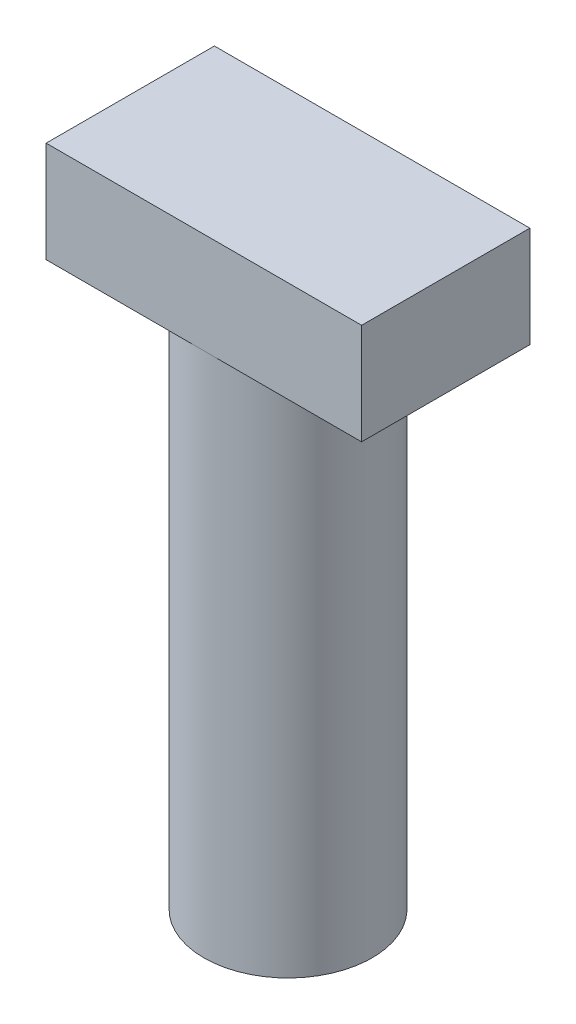
ISO-10303-21;
HEADER;
FILE_DESCRIPTION(('STEP AP214'),'2;1');
FILE_NAME('part.step','',(''),(''),'','','');
FILE_SCHEMA(('AUTOMOTIVE_DESIGN { 1 0 10303 214 1 1 1 1 }'));
ENDSEC;
DATA;
#1=APPLICATION_CONTEXT('core data for automotive mechanical design processes');
#2=APPLICATION_PROTOCOL_DEFINITION('international standard','automotive_design',2000,#1);
#3=PRODUCT_CONTEXT('',#1,'mechanical');
#4=PRODUCT('Part','Part','',(#3));
#5=PRODUCT_RELATED_PRODUCT_CATEGORY('part','',(#4));
#6=PRODUCT_DEFINITION_FORMATION('','',#4);
#7=PRODUCT_DEFINITION_CONTEXT('part definition',#1,'design');
#8=PRODUCT_DEFINITION('design','',#6,#7);
#9=PRODUCT_DEFINITION_SHAPE('','',#8);
#10=(LENGTH_UNIT() NAMED_UNIT(*) SI_UNIT(.MILLI.,.METRE.));
#11=(NAMED_UNIT(*) PLANE_ANGLE_UNIT() SI_UNIT($,.RADIAN.));
#12=(NAMED_UNIT(*) SI_UNIT($,.STERADIAN.) SOLID_ANGLE_UNIT());
#13=UNCERTAINTY_MEASURE_WITH_UNIT(LENGTH_MEASURE(1.E-05),#10,'distance_accuracy_value','');
#14=(GEOMETRIC_REPRESENTATION_CONTEXT(3) GLOBAL_UNCERTAINTY_ASSIGNED_CONTEXT((#13)) GLOBAL_UNIT_ASSIGNED_CONTEXT((#10,
#11,#12)) REPRESENTATION_CONTEXT('',''));
#15=CARTESIAN_POINT('',(0.,0.,0.));
#16=DIRECTION('',(0.,0.,1.));
#17=DIRECTION('',(1.,0.,0.));
#18=AXIS2_PLACEMENT_3D('',#15,#16,#17);
#19=CARTESIAN_POINT('',(0.,25.,0.));
#20=DIRECTION('',(0.,-1.,0.));
#21=DIRECTION('',(0.,0.,-1.));
#22=AXIS2_PLACEMENT_3D('',#19,#20,#21);
#23=CYLINDRICAL_SURFACE('',#22,4.);
#24=CARTESIAN_POINT('',(0.,25.,0.));
#25=DIRECTION('',(0.,1.,0.));
#26=DIRECTION('',(0.,0.,1.));
#27=AXIS2_PLACEMENT_3D('',#24,#25,#26);
#28=CIRCLE('',#27,4.);
#29=CARTESIAN_POINT('',(0.,25.,4.));
#30=VERTEX_POINT('',#29);
#31=CARTESIAN_POINT('',(0.,25.,-4.));
#32=VERTEX_POINT('',#31);
#33=EDGE_CURVE('E11',#30,#32,#28,.T.);
#34=ORIENTED_EDGE('',*,*,#33,.F.);
#35=EDGE_CURVE('E41',#32,#30,#28,.T.);
#36=ORIENTED_EDGE('',*,*,#35,.F.);
#37=EDGE_LOOP('',(#34,#36));
#38=FACE_BOUND('',#37,.T.);
#39=CARTESIAN_POINT('',(0.,0.,0.));
#40=DIRECTION('',(0.,1.,0.));
#41=DIRECTION('',(0.,0.,1.));
#42=AXIS2_PLACEMENT_3D('',#39,#40,#41);
#43=CIRCLE('',#42,4.);
#44=CARTESIAN_POINT('',(0.,0.,4.));
#45=VERTEX_POINT('',#44);
#46=EDGE_CURVE('E36',#45,#45,#43,.T.);
#47=ORIENTED_EDGE('',*,*,#46,.T.);
#48=EDGE_LOOP('',(#47));
#49=FACE_BOUND('',#48,.T.);
#50=ADVANCED_FACE('F33',(#38,#49),#23,.T.);
#51=CARTESIAN_POINT('',(0.,0.,0.));
#52=DIRECTION('',(0.,1.,0.));
#53=DIRECTION('',(0.,0.,1.));
#54=AXIS2_PLACEMENT_3D('',#51,#52,#53);
#55=PLANE('',#54);
#56=ORIENTED_EDGE('',*,*,#46,.F.);
#57=EDGE_LOOP('',(#56));
#58=FACE_BOUND('',#57,.T.);
#59=ADVANCED_FACE('F140',(#58),#55,.F.);
#60=CARTESIAN_POINT('',(0.,25.,0.));
#61=DIRECTION('',(0.,-1.,0.));
#62=DIRECTION('',(0.,0.,-1.));
#63=AXIS2_PLACEMENT_3D('',#60,#61,#62);
#64=PLANE('',#63);
#65=DIRECTION('',(1.,0.,0.));
#66=VECTOR('',#65,1.);
#67=CARTESIAN_POINT('',(-7.5,25.,4.));
#68=LINE('',#67,#66);
#69=CARTESIAN_POINT('',(7.5,25.,4.));
#70=VERTEX_POINT('',#69);
#71=EDGE_CURVE('E111',#30,#70,#68,.T.);
#72=ORIENTED_EDGE('',*,*,#71,.F.);
#73=ORIENTED_EDGE('',*,*,#33,.T.);
#74=DIRECTION('',(-1.,0.,0.));
#75=VECTOR('',#74,1.);
#76=CARTESIAN_POINT('',(-7.5,25.,-4.));
#77=LINE('',#76,#75);
#78=CARTESIAN_POINT('',(7.5,25.,-4.));
#79=VERTEX_POINT('',#78);
#80=EDGE_CURVE('E114',#79,#32,#77,.T.);
#81=ORIENTED_EDGE('',*,*,#80,.F.);
#82=DIRECTION('',(0.,0.,-1.));
#83=VECTOR('',#82,1.);
#84=CARTESIAN_POINT('',(7.5,25.,4.));
#85=LINE('',#84,#83);
#86=EDGE_CURVE('E99',#70,#79,#85,.T.);
#87=ORIENTED_EDGE('',*,*,#86,.F.);
#88=EDGE_LOOP('',(#72,#73,#81,#87));
#89=FACE_BOUND('',#88,.T.);
#90=ADVANCED_FACE('F128',(#89),#64,.T.);
#91=CARTESIAN_POINT('',(7.5,29.8,4.));
#92=DIRECTION('',(-1.,0.,0.));
#93=DIRECTION('',(0.,0.,1.));
#94=AXIS2_PLACEMENT_3D('',#91,#92,#93);
#95=PLANE('',#94);
#96=ORIENTED_EDGE('',*,*,#86,.T.);
#97=DIRECTION('',(0.,-1.,0.));
#98=VECTOR('',#97,1.);
#99=CARTESIAN_POINT('',(7.5,29.8,-4.));
#100=LINE('',#99,#98);
#101=CARTESIAN_POINT('',(7.5,29.8,-4.));
#102=VERTEX_POINT('',#101);
#103=EDGE_CURVE('E79',#102,#79,#100,.T.);
#104=ORIENTED_EDGE('',*,*,#103,.F.);
#105=DIRECTION('',(0.,0.,-1.));
#106=VECTOR('',#105,1.);
#107=CARTESIAN_POINT('',(7.5,29.8,4.));
#108=LINE('',#107,#106);
#109=CARTESIAN_POINT('',(7.5,29.8,4.));
#110=VERTEX_POINT('',#109);
#111=EDGE_CURVE('E86',#110,#102,#108,.T.);
#112=ORIENTED_EDGE('',*,*,#111,.F.);
#113=DIRECTION('',(0.,-1.,0.));
#114=VECTOR('',#113,1.);
#115=CARTESIAN_POINT('',(7.5,29.8,4.));
#116=LINE('',#115,#114);
#117=EDGE_CURVE('E107',#110,#70,#116,.T.);
#118=ORIENTED_EDGE('',*,*,#117,.T.);
#119=EDGE_LOOP('',(#96,#104,#112,#118));
#120=FACE_BOUND('',#119,.T.);
#121=ADVANCED_FACE('F97',(#120),#95,.F.);
#122=CARTESIAN_POINT('',(-7.5,29.8,-4.));
#123=DIRECTION('',(0.,0.,1.));
#124=DIRECTION('',(1.,0.,0.));
#125=AXIS2_PLACEMENT_3D('',#122,#123,#124);
#126=PLANE('',#125);
#127=ORIENTED_EDGE('',*,*,#80,.T.);
#128=CARTESIAN_POINT('',(-7.5,25.,-4.));
#129=VERTEX_POINT('',#128);
#130=EDGE_CURVE('E116',#32,#129,#77,.T.);
#131=ORIENTED_EDGE('',*,*,#130,.T.);
#132=DIRECTION('',(0.,-1.,0.));
#133=VECTOR('',#132,1.);
#134=CARTESIAN_POINT('',(-7.5,29.8,-4.));
#135=LINE('',#134,#133);
#136=CARTESIAN_POINT('',(-7.5,29.8,-4.));
#137=VERTEX_POINT('',#136);
#138=EDGE_CURVE('E82',#137,#129,#135,.T.);
#139=ORIENTED_EDGE('',*,*,#138,.F.);
#140=DIRECTION('',(-1.,0.,0.));
#141=VECTOR('',#140,1.);
#142=CARTESIAN_POINT('',(-7.5,29.8,-4.));
#143=LINE('',#142,#141);
#144=EDGE_CURVE('E74',#102,#137,#143,.T.);
#145=ORIENTED_EDGE('',*,*,#144,.F.);
#146=ORIENTED_EDGE('',*,*,#103,.T.);
#147=EDGE_LOOP('',(#127,#131,#139,#145,#146));
#148=FACE_BOUND('',#147,.T.);
#149=ADVANCED_FACE('F77',(#148),#126,.F.);
#150=CARTESIAN_POINT('',(-7.5,29.8,4.));
#151=DIRECTION('',(1.,0.,0.));
#152=DIRECTION('',(0.,0.,-1.));
#153=AXIS2_PLACEMENT_3D('',#150,#151,#152);
#154=PLANE('',#153);
#155=DIRECTION('',(0.,0.,1.));
#156=VECTOR('',#155,1.);
#157=CARTESIAN_POINT('',(-7.5,25.,4.));
#158=LINE('',#157,#156);
#159=CARTESIAN_POINT('',(-7.5,25.,4.));
#160=VERTEX_POINT('',#159);
#161=EDGE_CURVE('E112',#129,#160,#158,.T.);
#162=ORIENTED_EDGE('',*,*,#161,.T.);
#163=DIRECTION('',(0.,-1.,0.));
#164=VECTOR('',#163,1.);
#165=CARTESIAN_POINT('',(-7.5,29.8,4.));
#166=LINE('',#165,#164);
#167=CARTESIAN_POINT('',(-7.5,29.8,4.));
#168=VERTEX_POINT('',#167);
#169=EDGE_CURVE('E102',#168,#160,#166,.T.);
#170=ORIENTED_EDGE('',*,*,#169,.F.);
#171=DIRECTION('',(0.,0.,1.));
#172=VECTOR('',#171,1.);
#173=CARTESIAN_POINT('',(-7.5,29.8,4.));
#174=LINE('',#173,#172);
#175=EDGE_CURVE('E85',#137,#168,#174,.T.);
#176=ORIENTED_EDGE('',*,*,#175,.F.);
#177=ORIENTED_EDGE('',*,*,#138,.T.);
#178=EDGE_LOOP('',(#162,#170,#176,#177));
#179=FACE_BOUND('',#178,.T.);
#180=ADVANCED_FACE('F121',(#179),#154,.F.);
#181=CARTESIAN_POINT('',(-7.5,29.8,4.));
#182=DIRECTION('',(0.,0.,-1.));
#183=DIRECTION('',(-1.,0.,0.));
#184=AXIS2_PLACEMENT_3D('',#181,#182,#183);
#185=PLANE('',#184);
#186=EDGE_CURVE('E95',#160,#30,#68,.T.);
#187=ORIENTED_EDGE('',*,*,#186,.T.);
#188=ORIENTED_EDGE('',*,*,#71,.T.);
#189=ORIENTED_EDGE('',*,*,#117,.F.);
#190=DIRECTION('',(1.,0.,0.));
#191=VECTOR('',#190,1.);
#192=CARTESIAN_POINT('',(-7.5,29.8,4.));
#193=LINE('',#192,#191);
#194=EDGE_CURVE('E91',#168,#110,#193,.T.);
#195=ORIENTED_EDGE('',*,*,#194,.F.);
#196=ORIENTED_EDGE('',*,*,#169,.T.);
#197=EDGE_LOOP('',(#187,#188,#189,#195,#196));
#198=FACE_BOUND('',#197,.T.);
#199=ADVANCED_FACE('F125',(#198),#185,.F.);
#200=CARTESIAN_POINT('',(0.,29.8,0.));
#201=DIRECTION('',(0.,-1.,0.));
#202=DIRECTION('',(0.,0.,-1.));
#203=AXIS2_PLACEMENT_3D('',#200,#201,#202);
#204=PLANE('',#203);
#205=ORIENTED_EDGE('',*,*,#111,.T.);
#206=ORIENTED_EDGE('',*,*,#144,.T.);
#207=ORIENTED_EDGE('',*,*,#175,.T.);
#208=ORIENTED_EDGE('',*,*,#194,.T.);
#209=EDGE_LOOP('',(#205,#206,#207,#208));
#210=FACE_BOUND('',#209,.T.);
#211=ADVANCED_FACE('F89',(#210),#204,.F.);
#212=ORIENTED_EDGE('',*,*,#130,.F.);
#213=ORIENTED_EDGE('',*,*,#35,.T.);
#214=ORIENTED_EDGE('',*,*,#186,.F.);
#215=ORIENTED_EDGE('',*,*,#161,.F.);
#216=EDGE_LOOP('',(#212,#213,#214,#215));
#217=FACE_BOUND('',#216,.T.);
#218=ADVANCED_FACE('F131',(#217),#64,.T.);
#219=CLOSED_SHELL('',(#50,#59,#90,#121,#149,#180,#199,#211,#218));
#220=MANIFOLD_SOLID_BREP('B2',#219);
#221=ADVANCED_BREP_SHAPE_REPRESENTATION('',(#18,#220),#14);
#222=SHAPE_DEFINITION_REPRESENTATION(#9,#221);
ENDSEC;
END-ISO-10303-21;
